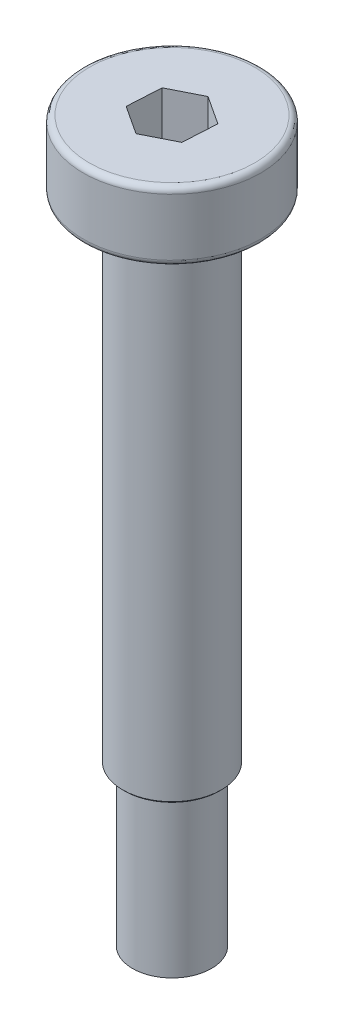
ISO-10303-21;
HEADER;
FILE_DESCRIPTION(('STEP AP214'),'2;1');
FILE_NAME('part.step','',(''),(''),'','','');
FILE_SCHEMA(('AUTOMOTIVE_DESIGN { 1 0 10303 214 1 1 1 1 }'));
ENDSEC;
DATA;
#1=APPLICATION_CONTEXT('core data for automotive mechanical design processes');
#2=APPLICATION_PROTOCOL_DEFINITION('international standard','automotive_design',2000,#1);
#3=PRODUCT_CONTEXT('',#1,'mechanical');
#4=PRODUCT('Part','Part','',(#3));
#5=PRODUCT_RELATED_PRODUCT_CATEGORY('part','',(#4));
#6=PRODUCT_DEFINITION_FORMATION('','',#4);
#7=PRODUCT_DEFINITION_CONTEXT('part definition',#1,'design');
#8=PRODUCT_DEFINITION('design','',#6,#7);
#9=PRODUCT_DEFINITION_SHAPE('','',#8);
#10=(LENGTH_UNIT() NAMED_UNIT(*) SI_UNIT(.MILLI.,.METRE.));
#11=(NAMED_UNIT(*) PLANE_ANGLE_UNIT() SI_UNIT($,.RADIAN.));
#12=(NAMED_UNIT(*) SI_UNIT($,.STERADIAN.) SOLID_ANGLE_UNIT());
#13=UNCERTAINTY_MEASURE_WITH_UNIT(LENGTH_MEASURE(1.E-05),#10,'distance_accuracy_value','');
#14=(GEOMETRIC_REPRESENTATION_CONTEXT(3) GLOBAL_UNCERTAINTY_ASSIGNED_CONTEXT((#13)) GLOBAL_UNIT_ASSIGNED_CONTEXT((#10,
#11,#12)) REPRESENTATION_CONTEXT('',''));
#15=CARTESIAN_POINT('',(0.,0.,0.));
#16=DIRECTION('',(0.,0.,1.));
#17=DIRECTION('',(1.,0.,0.));
#18=AXIS2_PLACEMENT_3D('',#15,#16,#17);
#19=CARTESIAN_POINT('',(0.,0.,0.));
#20=DIRECTION('',(0.,-1.,0.));
#21=DIRECTION('',(1.,0.,0.));
#22=AXIS2_PLACEMENT_3D('',#19,#20,#21);
#23=PLANE('',#22);
#24=DIRECTION('',(0.0564488998783232,0.,-0.998405489619587));
#25=VECTOR('',#24,1.);
#26=CARTESIAN_POINT('',(1.44872205311907,0.,0.949317867105888));
#27=LINE('',#26,#25);
#28=CARTESIAN_POINT('',(1.44872205311907,0.,0.949317867105888));
#29=VERTEX_POINT('',#28);
#30=CARTESIAN_POINT('',(1.54649441573969,0.,-0.779971167470918));
#31=VERTEX_POINT('',#30);
#32=EDGE_CURVE('E138',#29,#31,#27,.T.);
#33=ORIENTED_EDGE('',*,*,#32,.F.);
#34=DIRECTION('',(0.892868967227565,0.,-0.450316563499481));
#35=VECTOR('',#34,1.);
#36=CARTESIAN_POINT('',(-0.0977723626206245,0.,1.72928903457681));
#37=LINE('',#36,#35);
#38=CARTESIAN_POINT('',(-0.0977723626206245,0.,1.72928903457681));
#39=VERTEX_POINT('',#38);
#40=EDGE_CURVE('E64',#39,#29,#37,.T.);
#41=ORIENTED_EDGE('',*,*,#40,.F.);
#42=DIRECTION('',(0.836420067349241,0.,0.548088926120106));
#43=VECTOR('',#42,1.);
#44=CARTESIAN_POINT('',(-1.54649441573969,0.,0.779971167470918));
#45=LINE('',#44,#43);
#46=CARTESIAN_POINT('',(-1.54649441573969,0.,0.779971167470918));
#47=VERTEX_POINT('',#46);
#48=EDGE_CURVE('E147',#47,#39,#45,.T.);
#49=ORIENTED_EDGE('',*,*,#48,.F.);
#50=DIRECTION('',(-0.0564488998783237,0.,0.998405489619587));
#51=VECTOR('',#50,1.);
#52=CARTESIAN_POINT('',(-1.44872205311907,0.,-0.949317867105888));
#53=LINE('',#52,#51);
#54=CARTESIAN_POINT('',(-1.44872205311907,0.,-0.949317867105888));
#55=VERTEX_POINT('',#54);
#56=EDGE_CURVE('E145',#55,#47,#53,.T.);
#57=ORIENTED_EDGE('',*,*,#56,.F.);
#58=DIRECTION('',(-0.892868967227564,0.,0.450316563499481));
#59=VECTOR('',#58,1.);
#60=CARTESIAN_POINT('',(0.0977723626206254,0.,-1.72928903457681));
#61=LINE('',#60,#59);
#62=CARTESIAN_POINT('',(0.0977723626206254,0.,-1.72928903457681));
#63=VERTEX_POINT('',#62);
#64=EDGE_CURVE('E112',#63,#55,#61,.T.);
#65=ORIENTED_EDGE('',*,*,#64,.F.);
#66=DIRECTION('',(-0.836420067349241,0.,-0.548088926120106));
#67=VECTOR('',#66,1.);
#68=CARTESIAN_POINT('',(1.54649441573969,0.,-0.779971167470918));
#69=LINE('',#68,#67);
#70=EDGE_CURVE('E141',#31,#63,#69,.T.);
#71=ORIENTED_EDGE('',*,*,#70,.F.);
#72=EDGE_LOOP('',(#33,#41,#49,#57,#65,#71));
#73=FACE_BOUND('',#72,.T.);
#74=CARTESIAN_POINT('',(0.,0.,0.));
#75=DIRECTION('',(0.,-1.,0.));
#76=DIRECTION('',(1.,0.,0.));
#77=AXIS2_PLACEMENT_3D('',#74,#75,#76);
#78=CIRCLE('',#77,4.2);
#79=CARTESIAN_POINT('',(4.2,0.,0.));
#80=VERTEX_POINT('',#79);
#81=EDGE_CURVE('E174',#80,#80,#78,.F.);
#82=ORIENTED_EDGE('',*,*,#81,.T.);
#83=EDGE_LOOP('',(#82));
#84=FACE_BOUND('',#83,.T.);
#85=ADVANCED_FACE('F49',(#73,#84),#23,.F.);
#86=CARTESIAN_POINT('',(0.,-36.5,0.));
#87=DIRECTION('',(0.,-1.,0.));
#88=DIRECTION('',(1.,0.,0.));
#89=AXIS2_PLACEMENT_3D('',#86,#87,#88);
#90=CYLINDRICAL_SURFACE('',#89,4.5);
#91=CARTESIAN_POINT('',(0.,-3.2,0.));
#92=DIRECTION('',(0.,1.,0.));
#93=DIRECTION('',(-1.,0.,0.));
#94=AXIS2_PLACEMENT_3D('',#91,#92,#93);
#95=CIRCLE('',#94,4.5);
#96=CARTESIAN_POINT('',(-4.5,-3.2,0.));
#97=VERTEX_POINT('',#96);
#98=EDGE_CURVE('E171',#97,#97,#95,.T.);
#99=ORIENTED_EDGE('',*,*,#98,.T.);
#100=EDGE_LOOP('',(#99));
#101=FACE_BOUND('',#100,.T.);
#102=CARTESIAN_POINT('',(0.,-0.300000000000002,0.));
#103=DIRECTION('',(0.,-1.,0.));
#104=DIRECTION('',(1.,0.,0.));
#105=AXIS2_PLACEMENT_3D('',#102,#103,#104);
#106=CIRCLE('',#105,4.5);
#107=CARTESIAN_POINT('',(4.5,-0.300000000000001,0.));
#108=VERTEX_POINT('',#107);
#109=EDGE_CURVE('E168',#108,#108,#106,.T.);
#110=ORIENTED_EDGE('',*,*,#109,.T.);
#111=EDGE_LOOP('',(#110));
#112=FACE_BOUND('',#111,.T.);
#113=ADVANCED_FACE('F191',(#101,#112),#90,.T.);
#114=CARTESIAN_POINT('',(-4.5,-3.5,0.));
#115=DIRECTION('',(0.,1.,0.));
#116=DIRECTION('',(-1.,0.,0.));
#117=AXIS2_PLACEMENT_3D('',#114,#115,#116);
#118=PLANE('',#117);
#119=CARTESIAN_POINT('',(0.,-3.5,0.));
#120=DIRECTION('',(0.,1.,0.));
#121=DIRECTION('',(-1.,0.,0.));
#122=AXIS2_PLACEMENT_3D('',#119,#120,#121);
#123=CIRCLE('',#122,4.2);
#124=CARTESIAN_POINT('',(-4.2,-3.5,0.));
#125=VERTEX_POINT('',#124);
#126=EDGE_CURVE('E165',#125,#125,#123,.F.);
#127=ORIENTED_EDGE('',*,*,#126,.T.);
#128=EDGE_LOOP('',(#127));
#129=FACE_BOUND('',#128,.T.);
#130=CARTESIAN_POINT('',(0.,-3.5,0.));
#131=DIRECTION('',(0.,-1.,0.));
#132=DIRECTION('',(1.,0.,0.));
#133=AXIS2_PLACEMENT_3D('',#130,#131,#132);
#134=CIRCLE('',#133,2.5);
#135=CARTESIAN_POINT('',(2.5,-3.5,0.));
#136=VERTEX_POINT('',#135);
#137=EDGE_CURVE('E162',#136,#136,#134,.T.);
#138=ORIENTED_EDGE('',*,*,#137,.F.);
#139=EDGE_LOOP('',(#138));
#140=FACE_BOUND('',#139,.T.);
#141=ADVANCED_FACE('F197',(#129,#140),#118,.F.);
#142=CARTESIAN_POINT('',(0.,-36.5,0.));
#143=DIRECTION('',(0.,-1.,0.));
#144=DIRECTION('',(1.,0.,0.));
#145=AXIS2_PLACEMENT_3D('',#142,#143,#144);
#146=CYLINDRICAL_SURFACE('',#145,2.5);
#147=CARTESIAN_POINT('',(0.,-28.4,0.));
#148=DIRECTION('',(0.,1.,0.));
#149=DIRECTION('',(-1.,0.,0.));
#150=AXIS2_PLACEMENT_3D('',#147,#148,#149);
#151=CIRCLE('',#150,2.5);
#152=CARTESIAN_POINT('',(-2.5,-28.4,0.));
#153=VERTEX_POINT('',#152);
#154=EDGE_CURVE('E13',#153,#153,#151,.T.);
#155=ORIENTED_EDGE('',*,*,#154,.T.);
#156=EDGE_LOOP('',(#155));
#157=FACE_BOUND('',#156,.T.);
#158=ORIENTED_EDGE('',*,*,#137,.T.);
#159=EDGE_LOOP('',(#158));
#160=FACE_BOUND('',#159,.T.);
#161=ADVANCED_FACE('F237',(#157,#160),#146,.T.);
#162=CARTESIAN_POINT('',(-2.5,-28.5,0.));
#163=DIRECTION('',(0.,1.,0.));
#164=DIRECTION('',(-1.,0.,0.));
#165=AXIS2_PLACEMENT_3D('',#162,#163,#164);
#166=PLANE('',#165);
#167=CARTESIAN_POINT('',(0.,-28.5,0.));
#168=DIRECTION('',(0.,1.,0.));
#169=DIRECTION('',(-1.,0.,0.));
#170=AXIS2_PLACEMENT_3D('',#167,#168,#169);
#171=CIRCLE('',#170,2.4);
#172=CARTESIAN_POINT('',(-2.4,-28.5,0.));
#173=VERTEX_POINT('',#172);
#174=EDGE_CURVE('E57',#173,#173,#171,.F.);
#175=ORIENTED_EDGE('',*,*,#174,.T.);
#176=EDGE_LOOP('',(#175));
#177=FACE_BOUND('',#176,.T.);
#178=CARTESIAN_POINT('',(0.,-28.5,0.));
#179=DIRECTION('',(0.,-1.,0.));
#180=DIRECTION('',(1.,0.,0.));
#181=AXIS2_PLACEMENT_3D('',#178,#179,#180);
#182=CIRCLE('',#181,2.);
#183=CARTESIAN_POINT('',(2.,-28.5,0.));
#184=VERTEX_POINT('',#183);
#185=EDGE_CURVE('E159',#184,#184,#182,.T.);
#186=ORIENTED_EDGE('',*,*,#185,.F.);
#187=EDGE_LOOP('',(#186));
#188=FACE_BOUND('',#187,.T.);
#189=ADVANCED_FACE('F179',(#177,#188),#166,.F.);
#190=CARTESIAN_POINT('',(0.,-36.5,0.));
#191=DIRECTION('',(0.,-1.,0.));
#192=DIRECTION('',(1.,0.,0.));
#193=AXIS2_PLACEMENT_3D('',#190,#191,#192);
#194=CYLINDRICAL_SURFACE('',#193,2.);
#195=CARTESIAN_POINT('',(0.,-36.5,0.));
#196=DIRECTION('',(0.,-1.,0.));
#197=DIRECTION('',(1.,0.,0.));
#198=AXIS2_PLACEMENT_3D('',#195,#196,#197);
#199=CIRCLE('',#198,2.);
#200=CARTESIAN_POINT('',(2.,-36.5,0.));
#201=VERTEX_POINT('',#200);
#202=EDGE_CURVE('E151',#201,#201,#199,.T.);
#203=ORIENTED_EDGE('',*,*,#202,.F.);
#204=EDGE_LOOP('',(#203));
#205=FACE_BOUND('',#204,.T.);
#206=ORIENTED_EDGE('',*,*,#185,.T.);
#207=EDGE_LOOP('',(#206));
#208=FACE_BOUND('',#207,.T.);
#209=ADVANCED_FACE('F230',(#205,#208),#194,.T.);
#210=CARTESIAN_POINT('',(-2.,-36.5,0.));
#211=DIRECTION('',(0.,1.,0.));
#212=DIRECTION('',(-1.,0.,0.));
#213=AXIS2_PLACEMENT_3D('',#210,#211,#212);
#214=PLANE('',#213);
#215=ORIENTED_EDGE('',*,*,#202,.T.);
#216=EDGE_LOOP('',(#215));
#217=FACE_BOUND('',#216,.T.);
#218=ADVANCED_FACE('F207',(#217),#214,.F.);
#219=CARTESIAN_POINT('',(0.,-3.2,0.));
#220=DIRECTION('',(0.,1.,0.));
#221=DIRECTION('',(-1.,0.,0.));
#222=AXIS2_PLACEMENT_3D('',#219,#220,#221);
#223=TOROIDAL_SURFACE('',#222,4.2,0.3);
#224=ORIENTED_EDGE('',*,*,#98,.F.);
#225=EDGE_LOOP('',(#224));
#226=FACE_BOUND('',#225,.T.);
#227=ORIENTED_EDGE('',*,*,#126,.F.);
#228=EDGE_LOOP('',(#227));
#229=FACE_BOUND('',#228,.T.);
#230=ADVANCED_FACE('F204',(#226,#229),#223,.T.);
#231=CARTESIAN_POINT('',(0.,-0.300000000000002,0.));
#232=DIRECTION('',(0.,-1.,0.));
#233=DIRECTION('',(1.,0.,0.));
#234=AXIS2_PLACEMENT_3D('',#231,#232,#233);
#235=TOROIDAL_SURFACE('',#234,4.2,0.3);
#236=ORIENTED_EDGE('',*,*,#81,.F.);
#237=EDGE_LOOP('',(#236));
#238=FACE_BOUND('',#237,.T.);
#239=ORIENTED_EDGE('',*,*,#109,.F.);
#240=EDGE_LOOP('',(#239));
#241=FACE_BOUND('',#240,.T.);
#242=ADVANCED_FACE('F206',(#238,#241),#235,.T.);
#243=CARTESIAN_POINT('',(-0.0977723626206245,-2.4,1.72928903457681));
#244=DIRECTION('',(0.450316563499481,0.,0.892868967227565));
#245=DIRECTION('',(0.892868967227565,0.,-0.450316563499481));
#246=AXIS2_PLACEMENT_3D('',#243,#244,#245);
#247=PLANE('',#246);
#248=ORIENTED_EDGE('',*,*,#40,.T.);
#249=DIRECTION('',(0.,1.,0.));
#250=VECTOR('',#249,1.);
#251=CARTESIAN_POINT('',(1.44872205311907,-2.4,0.949317867105888));
#252=LINE('',#251,#250);
#253=CARTESIAN_POINT('',(1.44872205311907,-2.4,0.949317867105888));
#254=VERTEX_POINT('',#253);
#255=EDGE_CURVE('E94',#254,#29,#252,.T.);
#256=ORIENTED_EDGE('',*,*,#255,.F.);
#257=DIRECTION('',(0.892868967227565,0.,-0.450316563499481));
#258=VECTOR('',#257,1.);
#259=CARTESIAN_POINT('',(-0.0977723626206245,-2.4,1.72928903457681));
#260=LINE('',#259,#258);
#261=CARTESIAN_POINT('',(-0.0977723626206245,-2.4,1.72928903457681));
#262=VERTEX_POINT('',#261);
#263=EDGE_CURVE('E149',#262,#254,#260,.T.);
#264=ORIENTED_EDGE('',*,*,#263,.F.);
#265=DIRECTION('',(0.,1.,0.));
#266=VECTOR('',#265,1.);
#267=CARTESIAN_POINT('',(-0.0977723626206245,-2.4,1.72928903457681));
#268=LINE('',#267,#266);
#269=EDGE_CURVE('E72',#262,#39,#268,.T.);
#270=ORIENTED_EDGE('',*,*,#269,.T.);
#271=EDGE_LOOP('',(#248,#256,#264,#270));
#272=FACE_BOUND('',#271,.T.);
#273=ADVANCED_FACE('F210',(#272),#247,.F.);
#274=CARTESIAN_POINT('',(-1.54649441573969,-2.4,0.779971167470918));
#275=DIRECTION('',(-0.548088926120106,0.,0.836420067349241));
#276=DIRECTION('',(0.836420067349241,0.,0.548088926120106));
#277=AXIS2_PLACEMENT_3D('',#274,#275,#276);
#278=PLANE('',#277);
#279=ORIENTED_EDGE('',*,*,#48,.T.);
#280=ORIENTED_EDGE('',*,*,#269,.F.);
#281=DIRECTION('',(0.836420067349241,0.,0.548088926120106));
#282=VECTOR('',#281,1.);
#283=CARTESIAN_POINT('',(-1.54649441573969,-2.4,0.779971167470918));
#284=LINE('',#283,#282);
#285=CARTESIAN_POINT('',(-1.54649441573969,-2.4,0.779971167470918));
#286=VERTEX_POINT('',#285);
#287=EDGE_CURVE('E124',#286,#262,#284,.T.);
#288=ORIENTED_EDGE('',*,*,#287,.F.);
#289=DIRECTION('',(0.,1.,0.));
#290=VECTOR('',#289,1.);
#291=CARTESIAN_POINT('',(-1.54649441573969,-2.4,0.779971167470918));
#292=LINE('',#291,#290);
#293=EDGE_CURVE('E116',#286,#47,#292,.T.);
#294=ORIENTED_EDGE('',*,*,#293,.T.);
#295=EDGE_LOOP('',(#279,#280,#288,#294));
#296=FACE_BOUND('',#295,.T.);
#297=ADVANCED_FACE('F215',(#296),#278,.F.);
#298=CARTESIAN_POINT('',(-1.44872205311907,-2.4,-0.949317867105888));
#299=DIRECTION('',(-0.998405489619587,0.,-0.0564488998783237));
#300=DIRECTION('',(-0.0564488998783237,0.,0.998405489619587));
#301=AXIS2_PLACEMENT_3D('',#298,#299,#300);
#302=PLANE('',#301);
#303=ORIENTED_EDGE('',*,*,#56,.T.);
#304=ORIENTED_EDGE('',*,*,#293,.F.);
#305=DIRECTION('',(-0.0564488998783237,0.,0.998405489619587));
#306=VECTOR('',#305,1.);
#307=CARTESIAN_POINT('',(-1.44872205311907,-2.4,-0.949317867105888));
#308=LINE('',#307,#306);
#309=CARTESIAN_POINT('',(-1.44872205311907,-2.4,-0.949317867105888));
#310=VERTEX_POINT('',#309);
#311=EDGE_CURVE('E120',#310,#286,#308,.T.);
#312=ORIENTED_EDGE('',*,*,#311,.F.);
#313=DIRECTION('',(0.,1.,0.));
#314=VECTOR('',#313,1.);
#315=CARTESIAN_POINT('',(-1.44872205311907,-2.4,-0.949317867105888));
#316=LINE('',#315,#314);
#317=EDGE_CURVE('E105',#310,#55,#316,.T.);
#318=ORIENTED_EDGE('',*,*,#317,.T.);
#319=EDGE_LOOP('',(#303,#304,#312,#318));
#320=FACE_BOUND('',#319,.T.);
#321=ADVANCED_FACE('F121',(#320),#302,.F.);
#322=CARTESIAN_POINT('',(0.0977723626206254,-2.4,-1.72928903457681));
#323=DIRECTION('',(-0.450316563499481,0.,-0.892868967227565));
#324=DIRECTION('',(-0.892868967227565,0.,0.450316563499481));
#325=AXIS2_PLACEMENT_3D('',#322,#323,#324);
#326=PLANE('',#325);
#327=ORIENTED_EDGE('',*,*,#64,.T.);
#328=ORIENTED_EDGE('',*,*,#317,.F.);
#329=DIRECTION('',(-0.892868967227564,0.,0.450316563499481));
#330=VECTOR('',#329,1.);
#331=CARTESIAN_POINT('',(0.0977723626206254,-2.4,-1.72928903457681));
#332=LINE('',#331,#330);
#333=CARTESIAN_POINT('',(0.0977723626206254,-2.4,-1.72928903457681));
#334=VERTEX_POINT('',#333);
#335=EDGE_CURVE('E109',#334,#310,#332,.T.);
#336=ORIENTED_EDGE('',*,*,#335,.F.);
#337=DIRECTION('',(0.,1.,0.));
#338=VECTOR('',#337,1.);
#339=CARTESIAN_POINT('',(0.0977723626206254,-2.4,-1.72928903457681));
#340=LINE('',#339,#338);
#341=EDGE_CURVE('E117',#334,#63,#340,.T.);
#342=ORIENTED_EDGE('',*,*,#341,.T.);
#343=EDGE_LOOP('',(#327,#328,#336,#342));
#344=FACE_BOUND('',#343,.T.);
#345=ADVANCED_FACE('F107',(#344),#326,.F.);
#346=CARTESIAN_POINT('',(1.54649441573969,-2.4,-0.779971167470918));
#347=DIRECTION('',(0.548088926120106,0.,-0.836420067349241));
#348=DIRECTION('',(-0.836420067349241,0.,-0.548088926120106));
#349=AXIS2_PLACEMENT_3D('',#346,#347,#348);
#350=PLANE('',#349);
#351=ORIENTED_EDGE('',*,*,#70,.T.);
#352=ORIENTED_EDGE('',*,*,#341,.F.);
#353=DIRECTION('',(-0.836420067349241,0.,-0.548088926120106));
#354=VECTOR('',#353,1.);
#355=CARTESIAN_POINT('',(1.54649441573969,-2.4,-0.779971167470918));
#356=LINE('',#355,#354);
#357=CARTESIAN_POINT('',(1.54649441573969,-2.4,-0.779971167470918));
#358=VERTEX_POINT('',#357);
#359=EDGE_CURVE('E130',#358,#334,#356,.T.);
#360=ORIENTED_EDGE('',*,*,#359,.F.);
#361=DIRECTION('',(0.,1.,0.));
#362=VECTOR('',#361,1.);
#363=CARTESIAN_POINT('',(1.54649441573969,-2.4,-0.779971167470918));
#364=LINE('',#363,#362);
#365=EDGE_CURVE('E154',#358,#31,#364,.T.);
#366=ORIENTED_EDGE('',*,*,#365,.T.);
#367=EDGE_LOOP('',(#351,#352,#360,#366));
#368=FACE_BOUND('',#367,.T.);
#369=ADVANCED_FACE('F308',(#368),#350,.F.);
#370=CARTESIAN_POINT('',(1.44872205311907,-2.4,0.949317867105888));
#371=DIRECTION('',(0.998405489619587,0.,0.0564488998783232));
#372=DIRECTION('',(0.0564488998783232,0.,-0.998405489619587));
#373=AXIS2_PLACEMENT_3D('',#370,#371,#372);
#374=PLANE('',#373);
#375=ORIENTED_EDGE('',*,*,#32,.T.);
#376=ORIENTED_EDGE('',*,*,#365,.F.);
#377=DIRECTION('',(0.0564488998783232,0.,-0.998405489619587));
#378=VECTOR('',#377,1.);
#379=CARTESIAN_POINT('',(1.44872205311907,-2.4,0.949317867105888));
#380=LINE('',#379,#378);
#381=EDGE_CURVE('E132',#254,#358,#380,.T.);
#382=ORIENTED_EDGE('',*,*,#381,.F.);
#383=ORIENTED_EDGE('',*,*,#255,.T.);
#384=EDGE_LOOP('',(#375,#376,#382,#383));
#385=FACE_BOUND('',#384,.T.);
#386=ADVANCED_FACE('F187',(#385),#374,.F.);
#387=CARTESIAN_POINT('',(0.,-2.4,0.));
#388=DIRECTION('',(0.,1.,0.));
#389=DIRECTION('',(0.,0.,1.));
#390=AXIS2_PLACEMENT_3D('',#387,#388,#389);
#391=PLANE('',#390);
#392=ORIENTED_EDGE('',*,*,#263,.T.);
#393=ORIENTED_EDGE('',*,*,#381,.T.);
#394=ORIENTED_EDGE('',*,*,#359,.T.);
#395=ORIENTED_EDGE('',*,*,#335,.T.);
#396=ORIENTED_EDGE('',*,*,#311,.T.);
#397=ORIENTED_EDGE('',*,*,#287,.T.);
#398=EDGE_LOOP('',(#392,#393,#394,#395,#396,#397));
#399=FACE_BOUND('',#398,.T.);
#400=ADVANCED_FACE('F127',(#399),#391,.T.);
#401=CARTESIAN_POINT('',(0.,-28.5,0.));
#402=DIRECTION('',(0.,1.,0.));
#403=DIRECTION('',(-1.,0.,0.));
#404=AXIS2_PLACEMENT_3D('',#401,#402,#403);
#405=CONICAL_SURFACE('',#404,2.4,0.785398163397459);
#406=ORIENTED_EDGE('',*,*,#154,.F.);
#407=EDGE_LOOP('',(#406));
#408=FACE_BOUND('',#407,.T.);
#409=ORIENTED_EDGE('',*,*,#174,.F.);
#410=EDGE_LOOP('',(#409));
#411=FACE_BOUND('',#410,.T.);
#412=ADVANCED_FACE('F51',(#408,#411),#405,.T.);
#413=CLOSED_SHELL('',(#85,#113,#141,#161,#189,#209,#218,#230,#242,#273,#297,#321,#345,#369,#386,
#400,#412));
#414=MANIFOLD_SOLID_BREP('B2',#413);
#415=ADVANCED_BREP_SHAPE_REPRESENTATION('',(#18,#414),#14);
#416=SHAPE_DEFINITION_REPRESENTATION(#9,#415);
ENDSEC;
END-ISO-10303-21;
